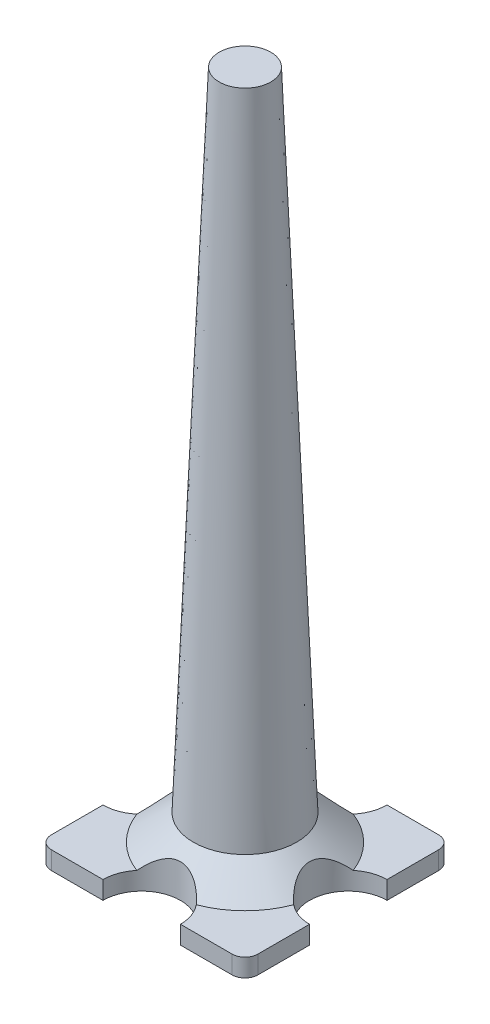
ISO-10303-21;
HEADER;
FILE_DESCRIPTION(('STEP AP214'),'2;1');
FILE_NAME('part.step','',(''),(''),'','','');
FILE_SCHEMA(('AUTOMOTIVE_DESIGN { 1 0 10303 214 1 1 1 1 }'));
ENDSEC;
DATA;
#1=APPLICATION_CONTEXT('core data for automotive mechanical design processes');
#2=APPLICATION_PROTOCOL_DEFINITION('international standard','automotive_design',2000,#1);
#3=PRODUCT_CONTEXT('',#1,'mechanical');
#4=PRODUCT('Part','Part','',(#3));
#5=PRODUCT_RELATED_PRODUCT_CATEGORY('part','',(#4));
#6=PRODUCT_DEFINITION_FORMATION('','',#4);
#7=PRODUCT_DEFINITION_CONTEXT('part definition',#1,'design');
#8=PRODUCT_DEFINITION('design','',#6,#7);
#9=PRODUCT_DEFINITION_SHAPE('','',#8);
#10=(LENGTH_UNIT() NAMED_UNIT(*) SI_UNIT(.MILLI.,.METRE.));
#11=(NAMED_UNIT(*) PLANE_ANGLE_UNIT() SI_UNIT($,.RADIAN.));
#12=(NAMED_UNIT(*) SI_UNIT($,.STERADIAN.) SOLID_ANGLE_UNIT());
#13=UNCERTAINTY_MEASURE_WITH_UNIT(LENGTH_MEASURE(1.E-05),#10,'distance_accuracy_value','');
#14=(GEOMETRIC_REPRESENTATION_CONTEXT(3) GLOBAL_UNCERTAINTY_ASSIGNED_CONTEXT((#13)) GLOBAL_UNIT_ASSIGNED_CONTEXT((#10,
#11,#12)) REPRESENTATION_CONTEXT('',''));
#15=CARTESIAN_POINT('',(0.,0.,0.));
#16=DIRECTION('',(0.,0.,1.));
#17=DIRECTION('',(1.,0.,0.));
#18=AXIS2_PLACEMENT_3D('',#15,#16,#17);
#19=CARTESIAN_POINT('',(44.45,8.89,-44.45));
#20=DIRECTION('',(0.,1.,0.));
#21=DIRECTION('',(0.,0.,1.));
#22=AXIS2_PLACEMENT_3D('',#19,#20,#21);
#23=PLANE('',#22);
#24=CARTESIAN_POINT('',(-50.8,8.89,0.));
#25=DIRECTION('',(0.,1.,0.));
#26=DIRECTION('',(0.,0.,1.));
#27=AXIS2_PLACEMENT_3D('',#24,#25,#26);
#28=CIRCLE('',#27,19.05);
#29=CARTESIAN_POINT('',(-50.8,8.89,19.05));
#30=VERTEX_POINT('',#29);
#31=CARTESIAN_POINT('',(-38.59609375,8.89000000000001,14.6276167655983));
#32=VERTEX_POINT('',#31);
#33=EDGE_CURVE('E56',#30,#32,#28,.T.);
#34=ORIENTED_EDGE('',*,*,#33,.F.);
#35=DIRECTION('',(0.,0.,1.));
#36=VECTOR('',#35,1.);
#37=CARTESIAN_POINT('',(-50.8,8.89,44.45));
#38=LINE('',#37,#36);
#39=CARTESIAN_POINT('',(-50.8,8.89,44.45));
#40=VERTEX_POINT('',#39);
#41=EDGE_CURVE('E194',#30,#40,#38,.T.);
#42=ORIENTED_EDGE('',*,*,#41,.T.);
#43=CARTESIAN_POINT('',(-44.45,8.89,44.45));
#44=DIRECTION('',(0.,1.,0.));
#45=DIRECTION('',(0.,0.,-1.));
#46=AXIS2_PLACEMENT_3D('',#43,#44,#45);
#47=CIRCLE('',#46,6.35);
#48=CARTESIAN_POINT('',(-44.45,8.89,50.8));
#49=VERTEX_POINT('',#48);
#50=EDGE_CURVE('E315',#40,#49,#47,.T.);
#51=ORIENTED_EDGE('',*,*,#50,.T.);
#52=DIRECTION('',(1.,0.,0.));
#53=VECTOR('',#52,1.);
#54=CARTESIAN_POINT('',(44.45,8.89,50.8));
#55=LINE('',#54,#53);
#56=CARTESIAN_POINT('',(-19.05,8.89,50.8));
#57=VERTEX_POINT('',#56);
#58=EDGE_CURVE('E318',#49,#57,#55,.T.);
#59=ORIENTED_EDGE('',*,*,#58,.T.);
#60=CARTESIAN_POINT('',(0.,8.89,50.8));
#61=DIRECTION('',(0.,1.,0.));
#62=DIRECTION('',(0.,0.,1.));
#63=AXIS2_PLACEMENT_3D('',#60,#61,#62);
#64=CIRCLE('',#63,19.05);
#65=CARTESIAN_POINT('',(-14.6276167655983,8.89,38.59609375));
#66=VERTEX_POINT('',#65);
#67=EDGE_CURVE('E372',#66,#57,#64,.T.);
#68=ORIENTED_EDGE('',*,*,#67,.F.);
#69=CARTESIAN_POINT('',(0.,8.89000000000001,0.));
#70=DIRECTION('',(0.,1.,0.));
#71=DIRECTION('',(0.,0.,1.));
#72=AXIS2_PLACEMENT_3D('',#69,#70,#71);
#73=CIRCLE('',#72,41.275);
#74=EDGE_CURVE('E300',#32,#66,#73,.T.);
#75=ORIENTED_EDGE('',*,*,#74,.F.);
#76=EDGE_LOOP('',(#34,#42,#51,#59,#68,#75));
#77=FACE_BOUND('',#76,.T.);
#78=ADVANCED_FACE('F35',(#77),#23,.T.);
#79=CARTESIAN_POINT('',(-50.8,8.89,44.45));
#80=DIRECTION('',(1.,0.,0.));
#81=DIRECTION('',(0.,0.,-1.));
#82=AXIS2_PLACEMENT_3D('',#79,#80,#81);
#83=PLANE('',#82);
#84=DIRECTION('',(0.,0.,1.));
#85=VECTOR('',#84,1.);
#86=CARTESIAN_POINT('',(-50.8,0.,44.45));
#87=LINE('',#86,#85);
#88=CARTESIAN_POINT('',(-50.8,0.,-44.4499999999999));
#89=VERTEX_POINT('',#88);
#90=CARTESIAN_POINT('',(-50.8,0.,-19.05));
#91=VERTEX_POINT('',#90);
#92=EDGE_CURVE('E200',#89,#91,#87,.T.);
#93=ORIENTED_EDGE('',*,*,#92,.T.);
#94=DIRECTION('',(0.,1.,0.));
#95=VECTOR('',#94,1.);
#96=CARTESIAN_POINT('',(-50.8,0.,-19.05));
#97=LINE('',#96,#95);
#98=CARTESIAN_POINT('',(-50.8,8.89,-19.05));
#99=VERTEX_POINT('',#98);
#100=EDGE_CURVE('E180',#91,#99,#97,.T.);
#101=ORIENTED_EDGE('',*,*,#100,.T.);
#102=CARTESIAN_POINT('',(-50.8,8.89,-44.4499999999999));
#103=VERTEX_POINT('',#102);
#104=EDGE_CURVE('E312',#103,#99,#38,.T.);
#105=ORIENTED_EDGE('',*,*,#104,.F.);
#106=DIRECTION('',(0.,-1.,0.));
#107=VECTOR('',#106,1.);
#108=CARTESIAN_POINT('',(-50.8,8.89,-44.4499999999999));
#109=LINE('',#108,#107);
#110=EDGE_CURVE('E234',#103,#89,#109,.T.);
#111=ORIENTED_EDGE('',*,*,#110,.T.);
#112=EDGE_LOOP('',(#93,#101,#105,#111));
#113=FACE_BOUND('',#112,.T.);
#114=ADVANCED_FACE('F345',(#113),#83,.F.);
#115=CARTESIAN_POINT('',(0.,8.89,-50.8));
#116=DIRECTION('',(0.,1.,0.));
#117=DIRECTION('',(0.,0.,1.));
#118=AXIS2_PLACEMENT_3D('',#115,#116,#117);
#119=CIRCLE('',#118,19.05);
#120=CARTESIAN_POINT('',(14.6276167655983,8.89,-38.59609375));
#121=VERTEX_POINT('',#120);
#122=CARTESIAN_POINT('',(19.05,8.89,-50.8));
#123=VERTEX_POINT('',#122);
#124=EDGE_CURVE('E296',#121,#123,#119,.T.);
#125=ORIENTED_EDGE('',*,*,#124,.F.);
#126=CARTESIAN_POINT('',(38.59609375,8.89000000000001,-14.6276167655983));
#127=VERTEX_POINT('',#126);
#128=EDGE_CURVE('E285',#127,#121,#73,.T.);
#129=ORIENTED_EDGE('',*,*,#128,.F.);
#130=CARTESIAN_POINT('',(50.8,8.89,0.));
#131=DIRECTION('',(0.,1.,0.));
#132=DIRECTION('',(0.,0.,1.));
#133=AXIS2_PLACEMENT_3D('',#130,#131,#132);
#134=CIRCLE('',#133,19.05);
#135=CARTESIAN_POINT('',(50.8,8.89,-19.05));
#136=VERTEX_POINT('',#135);
#137=EDGE_CURVE('E293',#136,#127,#134,.T.);
#138=ORIENTED_EDGE('',*,*,#137,.F.);
#139=DIRECTION('',(0.,0.,-1.));
#140=VECTOR('',#139,1.);
#141=CARTESIAN_POINT('',(50.8,8.89,44.45));
#142=LINE('',#141,#140);
#143=CARTESIAN_POINT('',(50.8,8.89,-44.45));
#144=VERTEX_POINT('',#143);
#145=EDGE_CURVE('E323',#136,#144,#142,.T.);
#146=ORIENTED_EDGE('',*,*,#145,.T.);
#147=CARTESIAN_POINT('',(44.45,8.89,-44.45));
#148=DIRECTION('',(0.,1.,0.));
#149=DIRECTION('',(0.,0.,1.));
#150=AXIS2_PLACEMENT_3D('',#147,#148,#149);
#151=CIRCLE('',#150,6.35);
#152=CARTESIAN_POINT('',(44.45,8.89,-50.8));
#153=VERTEX_POINT('',#152);
#154=EDGE_CURVE('E218',#144,#153,#151,.T.);
#155=ORIENTED_EDGE('',*,*,#154,.T.);
#156=DIRECTION('',(-1.,0.,0.));
#157=VECTOR('',#156,1.);
#158=CARTESIAN_POINT('',(44.45,8.89,-50.8));
#159=LINE('',#158,#157);
#160=EDGE_CURVE('E308',#153,#123,#159,.T.);
#161=ORIENTED_EDGE('',*,*,#160,.T.);
#162=EDGE_LOOP('',(#125,#129,#138,#146,#155,#161));
#163=FACE_BOUND('',#162,.T.);
#164=ADVANCED_FACE('F292',(#163),#23,.T.);
#165=CARTESIAN_POINT('',(44.45,8.89,-50.8));
#166=DIRECTION('',(0.,0.,1.));
#167=DIRECTION('',(1.,0.,0.));
#168=AXIS2_PLACEMENT_3D('',#165,#166,#167);
#169=PLANE('',#168);
#170=DIRECTION('',(-1.,0.,0.));
#171=VECTOR('',#170,1.);
#172=CARTESIAN_POINT('',(44.45,0.,-50.8));
#173=LINE('',#172,#171);
#174=CARTESIAN_POINT('',(44.45,0.,-50.8));
#175=VERTEX_POINT('',#174);
#176=CARTESIAN_POINT('',(19.05,0.,-50.8));
#177=VERTEX_POINT('',#176);
#178=EDGE_CURVE('E203',#175,#177,#173,.T.);
#179=ORIENTED_EDGE('',*,*,#178,.T.);
#180=DIRECTION('',(0.,1.,0.));
#181=VECTOR('',#180,1.);
#182=CARTESIAN_POINT('',(19.05,0.,-50.8));
#183=LINE('',#182,#181);
#184=EDGE_CURVE('E356',#177,#123,#183,.T.);
#185=ORIENTED_EDGE('',*,*,#184,.T.);
#186=ORIENTED_EDGE('',*,*,#160,.F.);
#187=DIRECTION('',(0.,-1.,0.));
#188=VECTOR('',#187,1.);
#189=CARTESIAN_POINT('',(44.45,8.89,-50.8));
#190=LINE('',#189,#188);
#191=EDGE_CURVE('E240',#153,#175,#190,.T.);
#192=ORIENTED_EDGE('',*,*,#191,.T.);
#193=EDGE_LOOP('',(#179,#185,#186,#192));
#194=FACE_BOUND('',#193,.T.);
#195=ADVANCED_FACE('F415',(#194),#169,.F.);
#196=CARTESIAN_POINT('',(-38.59609375,8.89000000000001,-14.6276167655982));
#197=VERTEX_POINT('',#196);
#198=EDGE_CURVE('E185',#197,#99,#28,.T.);
#199=ORIENTED_EDGE('',*,*,#198,.F.);
#200=CARTESIAN_POINT('',(-14.6276167655983,8.89000000000001,-38.59609375));
#201=VERTEX_POINT('',#200);
#202=EDGE_CURVE('E297',#201,#197,#73,.T.);
#203=ORIENTED_EDGE('',*,*,#202,.F.);
#204=CARTESIAN_POINT('',(-19.05,8.89,-50.8));
#205=VERTEX_POINT('',#204);
#206=EDGE_CURVE('E63',#205,#201,#119,.T.);
#207=ORIENTED_EDGE('',*,*,#206,.F.);
#208=CARTESIAN_POINT('',(-44.45,8.89,-50.8));
#209=VERTEX_POINT('',#208);
#210=EDGE_CURVE('E307',#205,#209,#159,.T.);
#211=ORIENTED_EDGE('',*,*,#210,.T.);
#212=CARTESIAN_POINT('',(-44.45,8.89,-44.45));
#213=DIRECTION('',(0.,1.,0.));
#214=DIRECTION('',(0.,0.,1.));
#215=AXIS2_PLACEMENT_3D('',#212,#213,#214);
#216=CIRCLE('',#215,6.35);
#217=EDGE_CURVE('E310',#209,#103,#216,.T.);
#218=ORIENTED_EDGE('',*,*,#217,.T.);
#219=ORIENTED_EDGE('',*,*,#104,.T.);
#220=EDGE_LOOP('',(#199,#203,#207,#211,#218,#219));
#221=FACE_BOUND('',#220,.T.);
#222=ADVANCED_FACE('F349',(#221),#23,.T.);
#223=CARTESIAN_POINT('',(50.8,8.89,44.45));
#224=DIRECTION('',(-1.,0.,0.));
#225=DIRECTION('',(0.,0.,1.));
#226=AXIS2_PLACEMENT_3D('',#223,#224,#225);
#227=PLANE('',#226);
#228=DIRECTION('',(0.,0.,-1.));
#229=VECTOR('',#228,1.);
#230=CARTESIAN_POINT('',(50.8,0.,44.45));
#231=LINE('',#230,#229);
#232=CARTESIAN_POINT('',(50.8,0.,44.45));
#233=VERTEX_POINT('',#232);
#234=CARTESIAN_POINT('',(50.8,0.,19.05));
#235=VERTEX_POINT('',#234);
#236=EDGE_CURVE('E215',#233,#235,#231,.T.);
#237=ORIENTED_EDGE('',*,*,#236,.T.);
#238=DIRECTION('',(0.,1.,0.));
#239=VECTOR('',#238,1.);
#240=CARTESIAN_POINT('',(50.8,0.,19.05));
#241=LINE('',#240,#239);
#242=CARTESIAN_POINT('',(50.8,8.89,19.05));
#243=VERTEX_POINT('',#242);
#244=EDGE_CURVE('E366',#235,#243,#241,.T.);
#245=ORIENTED_EDGE('',*,*,#244,.T.);
#246=CARTESIAN_POINT('',(50.8,8.89,44.45));
#247=VERTEX_POINT('',#246);
#248=EDGE_CURVE('E223',#247,#243,#142,.T.);
#249=ORIENTED_EDGE('',*,*,#248,.F.);
#250=DIRECTION('',(0.,-1.,0.));
#251=VECTOR('',#250,1.);
#252=CARTESIAN_POINT('',(50.8,8.89,44.45));
#253=LINE('',#252,#251);
#254=EDGE_CURVE('E222',#247,#233,#253,.T.);
#255=ORIENTED_EDGE('',*,*,#254,.T.);
#256=EDGE_LOOP('',(#237,#245,#249,#255));
#257=FACE_BOUND('',#256,.T.);
#258=ADVANCED_FACE('F405',(#257),#227,.F.);
#259=CARTESIAN_POINT('',(44.45,8.89,50.8));
#260=DIRECTION('',(0.,0.,-1.));
#261=DIRECTION('',(-1.,0.,0.));
#262=AXIS2_PLACEMENT_3D('',#259,#260,#261);
#263=PLANE('',#262);
#264=DIRECTION('',(1.,0.,0.));
#265=VECTOR('',#264,1.);
#266=CARTESIAN_POINT('',(44.45,0.,50.8));
#267=LINE('',#266,#265);
#268=CARTESIAN_POINT('',(-44.45,0.,50.8));
#269=VERTEX_POINT('',#268);
#270=CARTESIAN_POINT('',(-19.05,0.,50.8));
#271=VERTEX_POINT('',#270);
#272=EDGE_CURVE('E209',#269,#271,#267,.T.);
#273=ORIENTED_EDGE('',*,*,#272,.T.);
#274=DIRECTION('',(0.,1.,0.));
#275=VECTOR('',#274,1.);
#276=CARTESIAN_POINT('',(-19.05,0.,50.8));
#277=LINE('',#276,#275);
#278=EDGE_CURVE('E377',#271,#57,#277,.T.);
#279=ORIENTED_EDGE('',*,*,#278,.T.);
#280=ORIENTED_EDGE('',*,*,#58,.F.);
#281=DIRECTION('',(0.,-1.,0.));
#282=VECTOR('',#281,1.);
#283=CARTESIAN_POINT('',(-44.45,8.89,50.8));
#284=LINE('',#283,#282);
#285=EDGE_CURVE('E229',#49,#269,#284,.T.);
#286=ORIENTED_EDGE('',*,*,#285,.T.);
#287=EDGE_LOOP('',(#273,#279,#280,#286));
#288=FACE_BOUND('',#287,.T.);
#289=ADVANCED_FACE('F391',(#288),#263,.F.);
#290=CARTESIAN_POINT('',(38.59609375,8.89,14.6276167655983));
#291=VERTEX_POINT('',#290);
#292=EDGE_CURVE('E361',#291,#243,#134,.T.);
#293=ORIENTED_EDGE('',*,*,#292,.F.);
#294=CARTESIAN_POINT('',(14.6276167655983,8.89000000000001,38.59609375));
#295=VERTEX_POINT('',#294);
#296=EDGE_CURVE('E287',#295,#291,#73,.T.);
#297=ORIENTED_EDGE('',*,*,#296,.F.);
#298=CARTESIAN_POINT('',(19.05,8.89,50.8));
#299=VERTEX_POINT('',#298);
#300=EDGE_CURVE('E374',#299,#295,#64,.T.);
#301=ORIENTED_EDGE('',*,*,#300,.F.);
#302=CARTESIAN_POINT('',(44.45,8.89,50.8));
#303=VERTEX_POINT('',#302);
#304=EDGE_CURVE('E317',#299,#303,#55,.T.);
#305=ORIENTED_EDGE('',*,*,#304,.T.);
#306=CARTESIAN_POINT('',(44.45,8.89,44.45));
#307=DIRECTION('',(0.,1.,0.));
#308=DIRECTION('',(0.,0.,1.));
#309=AXIS2_PLACEMENT_3D('',#306,#307,#308);
#310=CIRCLE('',#309,6.35);
#311=EDGE_CURVE('E321',#303,#247,#310,.T.);
#312=ORIENTED_EDGE('',*,*,#311,.T.);
#313=ORIENTED_EDGE('',*,*,#248,.T.);
#314=EDGE_LOOP('',(#293,#297,#301,#305,#312,#313));
#315=FACE_BOUND('',#314,.T.);
#316=ADVANCED_FACE('F401',(#315),#23,.T.);
#317=CARTESIAN_POINT('',(44.45,8.89,-44.45));
#318=DIRECTION('',(0.,-1.,0.));
#319=DIRECTION('',(0.,0.,-1.));
#320=AXIS2_PLACEMENT_3D('',#317,#318,#319);
#321=CYLINDRICAL_SURFACE('',#320,6.35);
#322=CARTESIAN_POINT('',(44.45,0.,-44.45));
#323=DIRECTION('',(0.,1.,0.));
#324=DIRECTION('',(0.,0.,1.));
#325=AXIS2_PLACEMENT_3D('',#322,#323,#324);
#326=CIRCLE('',#325,6.35);
#327=CARTESIAN_POINT('',(50.8,0.,-44.45));
#328=VERTEX_POINT('',#327);
#329=EDGE_CURVE('E299',#328,#175,#326,.T.);
#330=ORIENTED_EDGE('',*,*,#329,.T.);
#331=ORIENTED_EDGE('',*,*,#191,.F.);
#332=ORIENTED_EDGE('',*,*,#154,.F.);
#333=DIRECTION('',(0.,-1.,0.));
#334=VECTOR('',#333,1.);
#335=CARTESIAN_POINT('',(50.8,8.89,-44.45));
#336=LINE('',#335,#334);
#337=EDGE_CURVE('E219',#144,#328,#336,.T.);
#338=ORIENTED_EDGE('',*,*,#337,.T.);
#339=EDGE_LOOP('',(#330,#331,#332,#338));
#340=FACE_BOUND('',#339,.T.);
#341=ADVANCED_FACE('F37',(#340),#321,.T.);
#342=ORIENTED_EDGE('',*,*,#210,.F.);
#343=DIRECTION('',(0.,1.,0.));
#344=VECTOR('',#343,1.);
#345=CARTESIAN_POINT('',(-19.05,0.,-50.8));
#346=LINE('',#345,#344);
#347=CARTESIAN_POINT('',(-19.05,0.,-50.8));
#348=VERTEX_POINT('',#347);
#349=EDGE_CURVE('E338',#205,#348,#346,.F.);
#350=ORIENTED_EDGE('',*,*,#349,.T.);
#351=CARTESIAN_POINT('',(-44.45,0.,-50.8));
#352=VERTEX_POINT('',#351);
#353=EDGE_CURVE('E327',#348,#352,#173,.T.);
#354=ORIENTED_EDGE('',*,*,#353,.T.);
#355=DIRECTION('',(0.,-1.,0.));
#356=VECTOR('',#355,1.);
#357=CARTESIAN_POINT('',(-44.45,8.89,-50.8));
#358=LINE('',#357,#356);
#359=EDGE_CURVE('E237',#209,#352,#358,.T.);
#360=ORIENTED_EDGE('',*,*,#359,.F.);
#361=EDGE_LOOP('',(#342,#350,#354,#360));
#362=FACE_BOUND('',#361,.T.);
#363=ADVANCED_FACE('F336',(#362),#169,.F.);
#364=CARTESIAN_POINT('',(-44.45,8.89,-44.45));
#365=DIRECTION('',(0.,-1.,0.));
#366=DIRECTION('',(0.,0.,-1.));
#367=AXIS2_PLACEMENT_3D('',#364,#365,#366);
#368=CYLINDRICAL_SURFACE('',#367,6.35);
#369=CARTESIAN_POINT('',(-44.45,0.,-44.45));
#370=DIRECTION('',(0.,1.,0.));
#371=DIRECTION('',(0.,0.,1.));
#372=AXIS2_PLACEMENT_3D('',#369,#370,#371);
#373=CIRCLE('',#372,6.35);
#374=EDGE_CURVE('E201',#352,#89,#373,.T.);
#375=ORIENTED_EDGE('',*,*,#374,.T.);
#376=ORIENTED_EDGE('',*,*,#110,.F.);
#377=ORIENTED_EDGE('',*,*,#217,.F.);
#378=ORIENTED_EDGE('',*,*,#359,.T.);
#379=EDGE_LOOP('',(#375,#376,#377,#378));
#380=FACE_BOUND('',#379,.T.);
#381=ADVANCED_FACE('F342',(#380),#368,.T.);
#382=ORIENTED_EDGE('',*,*,#41,.F.);
#383=DIRECTION('',(0.,1.,0.));
#384=VECTOR('',#383,1.);
#385=CARTESIAN_POINT('',(-50.8,0.,19.05));
#386=LINE('',#385,#384);
#387=CARTESIAN_POINT('',(-50.8,0.,19.05));
#388=VERTEX_POINT('',#387);
#389=EDGE_CURVE('E178',#30,#388,#386,.F.);
#390=ORIENTED_EDGE('',*,*,#389,.T.);
#391=CARTESIAN_POINT('',(-50.8,0.,44.45));
#392=VERTEX_POINT('',#391);
#393=EDGE_CURVE('E192',#388,#392,#87,.T.);
#394=ORIENTED_EDGE('',*,*,#393,.T.);
#395=DIRECTION('',(0.,-1.,0.));
#396=VECTOR('',#395,1.);
#397=CARTESIAN_POINT('',(-50.8,8.89,44.45));
#398=LINE('',#397,#396);
#399=EDGE_CURVE('E232',#40,#392,#398,.T.);
#400=ORIENTED_EDGE('',*,*,#399,.F.);
#401=EDGE_LOOP('',(#382,#390,#394,#400));
#402=FACE_BOUND('',#401,.T.);
#403=ADVANCED_FACE('F190',(#402),#83,.F.);
#404=CARTESIAN_POINT('',(-44.45,8.89,44.45));
#405=DIRECTION('',(0.,-1.,0.));
#406=DIRECTION('',(0.,0.,-1.));
#407=AXIS2_PLACEMENT_3D('',#404,#405,#406);
#408=CYLINDRICAL_SURFACE('',#407,6.35);
#409=CARTESIAN_POINT('',(-44.45,0.,44.45));
#410=DIRECTION('',(0.,1.,0.));
#411=DIRECTION('',(0.,0.,-1.));
#412=AXIS2_PLACEMENT_3D('',#409,#410,#411);
#413=CIRCLE('',#412,6.35);
#414=EDGE_CURVE('E199',#392,#269,#413,.T.);
#415=ORIENTED_EDGE('',*,*,#414,.T.);
#416=ORIENTED_EDGE('',*,*,#285,.F.);
#417=ORIENTED_EDGE('',*,*,#50,.F.);
#418=ORIENTED_EDGE('',*,*,#399,.T.);
#419=EDGE_LOOP('',(#415,#416,#417,#418));
#420=FACE_BOUND('',#419,.T.);
#421=ADVANCED_FACE('F443',(#420),#408,.T.);
#422=ORIENTED_EDGE('',*,*,#304,.F.);
#423=DIRECTION('',(0.,1.,0.));
#424=VECTOR('',#423,1.);
#425=CARTESIAN_POINT('',(19.05,0.,50.8));
#426=LINE('',#425,#424);
#427=CARTESIAN_POINT('',(19.05,0.,50.8));
#428=VERTEX_POINT('',#427);
#429=EDGE_CURVE('E375',#299,#428,#426,.F.);
#430=ORIENTED_EDGE('',*,*,#429,.T.);
#431=CARTESIAN_POINT('',(44.45,0.,50.8));
#432=VERTEX_POINT('',#431);
#433=EDGE_CURVE('E208',#428,#432,#267,.T.);
#434=ORIENTED_EDGE('',*,*,#433,.T.);
#435=DIRECTION('',(0.,-1.,0.));
#436=VECTOR('',#435,1.);
#437=CARTESIAN_POINT('',(44.45,8.89,50.8));
#438=LINE('',#437,#436);
#439=EDGE_CURVE('E226',#303,#432,#438,.T.);
#440=ORIENTED_EDGE('',*,*,#439,.F.);
#441=EDGE_LOOP('',(#422,#430,#434,#440));
#442=FACE_BOUND('',#441,.T.);
#443=ADVANCED_FACE('F397',(#442),#263,.F.);
#444=CARTESIAN_POINT('',(44.45,8.89,44.45));
#445=DIRECTION('',(0.,-1.,0.));
#446=DIRECTION('',(0.,0.,-1.));
#447=AXIS2_PLACEMENT_3D('',#444,#445,#446);
#448=CYLINDRICAL_SURFACE('',#447,6.35);
#449=CARTESIAN_POINT('',(44.45,0.,44.45));
#450=DIRECTION('',(0.,1.,0.));
#451=DIRECTION('',(0.,0.,1.));
#452=AXIS2_PLACEMENT_3D('',#449,#450,#451);
#453=CIRCLE('',#452,6.35);
#454=EDGE_CURVE('E212',#432,#233,#453,.T.);
#455=ORIENTED_EDGE('',*,*,#454,.T.);
#456=ORIENTED_EDGE('',*,*,#254,.F.);
#457=ORIENTED_EDGE('',*,*,#311,.F.);
#458=ORIENTED_EDGE('',*,*,#439,.T.);
#459=EDGE_LOOP('',(#455,#456,#457,#458));
#460=FACE_BOUND('',#459,.T.);
#461=ADVANCED_FACE('F442',(#460),#448,.T.);
#462=ORIENTED_EDGE('',*,*,#145,.F.);
#463=DIRECTION('',(0.,1.,0.));
#464=VECTOR('',#463,1.);
#465=CARTESIAN_POINT('',(50.8,0.,-19.05));
#466=LINE('',#465,#464);
#467=CARTESIAN_POINT('',(50.8,0.,-19.05));
#468=VERTEX_POINT('',#467);
#469=EDGE_CURVE('E363',#136,#468,#466,.F.);
#470=ORIENTED_EDGE('',*,*,#469,.T.);
#471=EDGE_CURVE('E214',#468,#328,#231,.T.);
#472=ORIENTED_EDGE('',*,*,#471,.T.);
#473=ORIENTED_EDGE('',*,*,#337,.F.);
#474=EDGE_LOOP('',(#462,#470,#472,#473));
#475=FACE_BOUND('',#474,.T.);
#476=ADVANCED_FACE('F410',(#475),#227,.F.);
#477=CARTESIAN_POINT('',(44.45,0.,-44.45));
#478=DIRECTION('',(0.,1.,0.));
#479=DIRECTION('',(0.,0.,1.));
#480=AXIS2_PLACEMENT_3D('',#477,#478,#479);
#481=PLANE('',#480);
#482=ORIENTED_EDGE('',*,*,#393,.F.);
#483=CARTESIAN_POINT('',(-50.8,0.,0.));
#484=DIRECTION('',(0.,1.,0.));
#485=DIRECTION('',(0.,0.,1.));
#486=AXIS2_PLACEMENT_3D('',#483,#484,#485);
#487=CIRCLE('',#486,19.05);
#488=EDGE_CURVE('E175',#388,#91,#487,.T.);
#489=ORIENTED_EDGE('',*,*,#488,.T.);
#490=ORIENTED_EDGE('',*,*,#92,.F.);
#491=ORIENTED_EDGE('',*,*,#374,.F.);
#492=ORIENTED_EDGE('',*,*,#353,.F.);
#493=CARTESIAN_POINT('',(0.,0.,-50.8));
#494=DIRECTION('',(0.,1.,0.));
#495=DIRECTION('',(0.,0.,1.));
#496=AXIS2_PLACEMENT_3D('',#493,#494,#495);
#497=CIRCLE('',#496,19.05);
#498=EDGE_CURVE('E350',#348,#177,#497,.T.);
#499=ORIENTED_EDGE('',*,*,#498,.T.);
#500=ORIENTED_EDGE('',*,*,#178,.F.);
#501=ORIENTED_EDGE('',*,*,#329,.F.);
#502=ORIENTED_EDGE('',*,*,#471,.F.);
#503=CARTESIAN_POINT('',(50.8,0.,0.));
#504=DIRECTION('',(0.,1.,0.));
#505=DIRECTION('',(0.,0.,1.));
#506=AXIS2_PLACEMENT_3D('',#503,#504,#505);
#507=CIRCLE('',#506,19.05);
#508=EDGE_CURVE('E358',#468,#235,#507,.T.);
#509=ORIENTED_EDGE('',*,*,#508,.T.);
#510=ORIENTED_EDGE('',*,*,#236,.F.);
#511=ORIENTED_EDGE('',*,*,#454,.F.);
#512=ORIENTED_EDGE('',*,*,#433,.F.);
#513=CARTESIAN_POINT('',(0.,0.,50.8));
#514=DIRECTION('',(0.,1.,0.));
#515=DIRECTION('',(0.,0.,1.));
#516=AXIS2_PLACEMENT_3D('',#513,#514,#515);
#517=CIRCLE('',#516,19.05);
#518=EDGE_CURVE('E369',#428,#271,#517,.T.);
#519=ORIENTED_EDGE('',*,*,#518,.T.);
#520=ORIENTED_EDGE('',*,*,#272,.F.);
#521=ORIENTED_EDGE('',*,*,#414,.F.);
#522=EDGE_LOOP('',(#482,#489,#490,#491,#492,#499,#500,#501,#502,#509,#510,#511,#512,#519,#520,#521));
#523=FACE_BOUND('',#522,.T.);
#524=ADVANCED_FACE('F197',(#523),#481,.F.);
#525=CARTESIAN_POINT('',(0.,8.89000000000001,0.));
#526=DIRECTION('',(0.,-1.,0.));
#527=DIRECTION('',(0.,0.,-1.));
#528=AXIS2_PLACEMENT_3D('',#525,#526,#527);
#529=CONICAL_SURFACE('',#528,41.275,0.896055384571344);
#530=CARTESIAN_POINT('',(0.,21.59,0.));
#531=DIRECTION('',(0.,1.,0.));
#532=DIRECTION('',(0.,0.,1.));
#533=AXIS2_PLACEMENT_3D('',#530,#531,#532);
#534=CIRCLE('',#533,25.4);
#535=CARTESIAN_POINT('',(0.,21.59,25.4));
#536=VERTEX_POINT('',#535);
#537=EDGE_CURVE('E303',#536,#536,#534,.T.);
#538=ORIENTED_EDGE('',*,*,#537,.F.);
#539=EDGE_LOOP('',(#538));
#540=FACE_BOUND('',#539,.T.);
#541=ORIENTED_EDGE('',*,*,#202,.T.);
#542=CARTESIAN_POINT('',(-38.5962968756152,8.8898,-14.6277862320954));
#543=CARTESIAN_POINT('',(-38.3895712066562,9.09334093258543,-14.4553103378079));
#544=CARTESIAN_POINT('',(-38.185879481952,9.29578372526318,-14.2779496232321));
#545=CARTESIAN_POINT('',(-37.7848155019923,9.69807231056853,-13.9133384710445));
#546=CARTESIAN_POINT('',(-37.5874440244564,9.89791778180636,-13.726086823787));
#547=CARTESIAN_POINT('',(-37.0045003504226,10.4936612258947,-13.1486256529755));
#548=CARTESIAN_POINT('',(-36.6289130128614,10.884963493328,-12.7433864180333));
#549=CARTESIAN_POINT('',(-35.9024158774759,11.655788068097,-11.8863197131806));
#550=CARTESIAN_POINT('',(-35.551924250546,12.0350693613105,-11.4339203664525));
#551=CARTESIAN_POINT('',(-34.8855084245347,12.7693458740593,-10.4864901727826));
#552=CARTESIAN_POINT('',(-34.569551316532,13.1243640914878,-9.99150072959529));
#553=CARTESIAN_POINT('',(-34.0836232321281,13.6797200681411,-9.14387974879918));
#554=CARTESIAN_POINT('',(-33.9020537398285,13.8897219669684,-8.80417218465487));
#555=CARTESIAN_POINT('',(-33.5565177485086,14.2935607959959,-8.10655988655948));
#556=CARTESIAN_POINT('',(-33.3925513912795,14.4873975959853,-7.74865500606516));
#557=CARTESIAN_POINT('',(-33.0847145466771,14.854831882197,-7.01628842765122));
#558=CARTESIAN_POINT('',(-32.9407655814761,15.0285079384004,-6.64189942636075));
#559=CARTESIAN_POINT('',(-32.6742937262959,15.3527492540423,-5.87584970924707));
#560=CARTESIAN_POINT('',(-32.5517662330081,15.503319477893,-5.48419272688742));
#561=CARTESIAN_POINT('',(-32.3511895496758,15.7515567021698,-4.75997589966932));
#562=CARTESIAN_POINT('',(-32.2691084943697,15.853849068057,-4.43011690308063));
#563=CARTESIAN_POINT('',(-32.1218428896968,16.038254329191,-3.7611407003961));
#564=CARTESIAN_POINT('',(-32.0566543322811,16.1203720110042,-3.42202571159642));
#565=CARTESIAN_POINT('',(-31.9443470350621,16.2623435952303,-2.73632649137669));
#566=CARTESIAN_POINT('',(-31.8972212804231,16.3222061403339,-2.38974521489371));
#567=CARTESIAN_POINT('',(-31.8219692842788,16.4180004521219,-1.69121993167089));
#568=CARTESIAN_POINT('',(-31.7938429491817,16.4539323366898,-1.33927595135669));
#569=CARTESIAN_POINT('',(-31.7571457817113,16.5008439581354,-0.631191903907878));
#570=CARTESIAN_POINT('',(-31.7486584095847,16.5117172018285,-0.275040370070849));
#571=CARTESIAN_POINT('',(-31.7516859898874,16.50784196876,0.437037657637589));
#572=CARTESIAN_POINT('',(-31.7632010194391,16.4930933932095,0.792964150636027));
#573=CARTESIAN_POINT('',(-31.8059689723253,16.4384460378205,1.50180575402912));
#574=CARTESIAN_POINT('',(-31.8372296383497,16.3985373921877,1.85471962806701));
#575=CARTESIAN_POINT('',(-31.9187937680413,16.2948029090494,2.55475149483904));
#576=CARTESIAN_POINT('',(-31.9690974541607,16.2309767921506,2.901869419818));
#577=CARTESIAN_POINT('',(-32.0843573539001,16.085472721074,3.56862774739105));
#578=CARTESIAN_POINT('',(-32.1483192018679,16.0050144358508,3.88870909883004));
#579=CARTESIAN_POINT('',(-32.2912720249076,15.8262179323484,4.52045375411812));
#580=CARTESIAN_POINT('',(-32.3702684101403,15.7278732782473,4.83211398139017));
#581=CARTESIAN_POINT('',(-32.6282272186782,15.4088520376549,5.75282652820665));
#582=CARTESIAN_POINT('',(-32.8282082017923,15.1641254998118,6.34788551065139));
#583=CARTESIAN_POINT('',(-33.2366343668702,14.6725917517083,7.39525313085371));
#584=CARTESIAN_POINT('',(-33.4375187063837,14.4335933076176,7.85435667858227));
#585=CARTESIAN_POINT('',(-33.8680156239613,13.9288361672021,8.74382467634853));
#586=CARTESIAN_POINT('',(-34.097644950071,13.6630618879083,9.1741721458275));
#587=CARTESIAN_POINT('',(-34.5830585410071,13.1097635224484,10.007327284111));
#588=CARTESIAN_POINT('',(-34.8389233932695,12.8221731732923,10.4100433470783));
#589=CARTESIAN_POINT('',(-35.3735327172093,12.2306464259561,11.1869955387313));
#590=CARTESIAN_POINT('',(-35.6522708641666,11.9267145543494,11.5612394854844));
#591=CARTESIAN_POINT('',(-36.1446474753079,11.3982770019186,12.1749177010246));
#592=CARTESIAN_POINT('',(-36.3530416623198,11.1769828858617,12.4213860130506));
#593=CARTESIAN_POINT('',(-36.7794724345684,10.7291318114562,12.900783055968));
#594=CARTESIAN_POINT('',(-36.9975081672571,10.5025753192678,13.1337129797847));
#595=CARTESIAN_POINT('',(-37.4408502469439,10.0469604888984,13.5843564222283));
#596=CARTESIAN_POINT('',(-37.6660829706643,9.81793752357738,13.8021783617043));
#597=CARTESIAN_POINT('',(-38.1249829254417,9.35634693685264,14.2247536938674));
#598=CARTESIAN_POINT('',(-38.3586496415529,9.12377953235741,14.4295078823128));
#599=CARTESIAN_POINT('',(-38.5962968756152,8.88980000000001,14.6277862320954));
#600=B_SPLINE_CURVE_WITH_KNOTS('',3,(#542,#543,#544,#545,#546,#547,#548,#549,#550,#551,#552,
#553,#554,#555,#556,#557,#558,#559,#560,#561,#562,#563,#564,#565,#566,#567,#568,#569,#570,#571,
#572,#573,#574,#575,#576,#577,#578,#579,#580,#581,#582,#583,#584,#585,#586,#587,#588,#589,#590,
#591,#592,#593,#594,#595,#596,#597,#598,#599),.UNSPECIFIED.,.F.,.F.,(4,2,2,2,2,2,2,2,2,2,2,2,2,
2,2,2,2,2,2,2,2,2,2,2,2,2,2,2,4),(0.,1.01242135860384,2.02496682273099,4.05403384803494,
6.11145419121535,8.16689654551862,9.48216662830086,10.7974473046485,12.1074165798777,
13.4171040059078,14.4810405701614,15.5447244647053,16.6079948494241,17.6712599963894,
18.7390354970724,19.806815114737,20.8750136919598,21.9432247477924,22.9507713639221,
23.958681232416,25.9736504905671,27.6371526310038,29.3016285491879,30.9713797644777,
32.6406708208015,33.8143208697777,34.9878673461487,36.1518618573755,37.3157854195988),.UNSPECIFIED.);
#601=EDGE_CURVE('E11',#197,#32,#600,.T.);
#602=ORIENTED_EDGE('',*,*,#601,.T.);
#603=ORIENTED_EDGE('',*,*,#74,.T.);
#604=CARTESIAN_POINT('',(-14.6277862320954,8.8898,38.5962968756152));
#605=CARTESIAN_POINT('',(-14.4553103378079,9.09334093258543,38.3895712066562));
#606=CARTESIAN_POINT('',(-14.2779496232321,9.29578372526318,38.185879481952));
#607=CARTESIAN_POINT('',(-13.9133384710445,9.69807231056853,37.7848155019923));
#608=CARTESIAN_POINT('',(-13.726086823787,9.89791778180636,37.5874440244564));
#609=CARTESIAN_POINT('',(-13.1486256529755,10.4936612258947,37.0045003504226));
#610=CARTESIAN_POINT('',(-12.7433864180333,10.884963493328,36.6289130128614));
#611=CARTESIAN_POINT('',(-11.8863197131806,11.655788068097,35.9024158774759));
#612=CARTESIAN_POINT('',(-11.4339203664525,12.0350693613105,35.551924250546));
#613=CARTESIAN_POINT('',(-10.4864901727826,12.7693458740593,34.8855084245347));
#614=CARTESIAN_POINT('',(-9.99150072959529,13.1243640914878,34.569551316532));
#615=CARTESIAN_POINT('',(-9.14387974879919,13.6797200681411,34.0836232321281));
#616=CARTESIAN_POINT('',(-8.80417218465488,13.8897219669684,33.9020537398285));
#617=CARTESIAN_POINT('',(-8.10655988655948,14.2935607959959,33.5565177485085));
#618=CARTESIAN_POINT('',(-7.74865500606516,14.4873975959854,33.3925513912795));
#619=CARTESIAN_POINT('',(-7.01628842765122,14.854831882197,33.0847145466771));
#620=CARTESIAN_POINT('',(-6.64189942636075,15.0285079384004,32.9407655814761));
#621=CARTESIAN_POINT('',(-5.87584970924707,15.3527492540423,32.6742937262959));
#622=CARTESIAN_POINT('',(-5.48419272688742,15.503319477893,32.5517662330081));
#623=CARTESIAN_POINT('',(-4.75997589966932,15.7515567021698,32.3511895496758));
#624=CARTESIAN_POINT('',(-4.43011690308063,15.853849068057,32.2691084943697));
#625=CARTESIAN_POINT('',(-3.76114070039611,16.038254329191,32.1218428896968));
#626=CARTESIAN_POINT('',(-3.42202571159642,16.1203720110042,32.0566543322811));
#627=CARTESIAN_POINT('',(-2.7363264913767,16.2623435952303,31.9443470350621));
#628=CARTESIAN_POINT('',(-2.38974521489372,16.3222061403339,31.8972212804231));
#629=CARTESIAN_POINT('',(-1.69121993167089,16.4180004521219,31.8219692842788));
#630=CARTESIAN_POINT('',(-1.33927595135669,16.4539323366898,31.7938429491817));
#631=CARTESIAN_POINT('',(-0.631191903907884,16.5008439581354,31.7571457817113));
#632=CARTESIAN_POINT('',(-0.275040370070856,16.5117172018285,31.7486584095847));
#633=CARTESIAN_POINT('',(0.437037657637582,16.50784196876,31.7516859898874));
#634=CARTESIAN_POINT('',(0.79296415063602,16.4930933932095,31.7632010194391));
#635=CARTESIAN_POINT('',(1.50180575402912,16.4384460378205,31.8059689723253));
#636=CARTESIAN_POINT('',(1.85471962806701,16.3985373921877,31.8372296383497));
#637=CARTESIAN_POINT('',(2.55475149483904,16.2948029090494,31.9187937680413));
#638=CARTESIAN_POINT('',(2.90186941981799,16.2309767921506,31.9690974541607));
#639=CARTESIAN_POINT('',(3.56862774739105,16.085472721074,32.0843573539001));
#640=CARTESIAN_POINT('',(3.88870909883003,16.0050144358508,32.1483192018679));
#641=CARTESIAN_POINT('',(4.52045375411812,15.8262179323484,32.2912720249076));
#642=CARTESIAN_POINT('',(4.83211398139016,15.7278732782473,32.3702684101403));
#643=CARTESIAN_POINT('',(5.75282652820664,15.4088520376549,32.6282272186782));
#644=CARTESIAN_POINT('',(6.34788551065139,15.1641254998118,32.8282082017923));
#645=CARTESIAN_POINT('',(7.3952531308537,14.6725917517083,33.2366343668702));
#646=CARTESIAN_POINT('',(7.85435667858226,14.4335933076176,33.4375187063837));
#647=CARTESIAN_POINT('',(8.74382467634851,13.9288361672021,33.8680156239613));
#648=CARTESIAN_POINT('',(9.17417214582749,13.6630618879083,34.097644950071));
#649=CARTESIAN_POINT('',(10.007327284111,13.1097635224485,34.5830585410071));
#650=CARTESIAN_POINT('',(10.4100433470782,12.8221731732923,34.8389233932695));
#651=CARTESIAN_POINT('',(11.1869955387313,12.2306464259561,35.3735327172093));
#652=CARTESIAN_POINT('',(11.5612394854844,11.9267145543494,35.6522708641666));
#653=CARTESIAN_POINT('',(12.1749177010246,11.3982770019186,36.1446474753079));
#654=CARTESIAN_POINT('',(12.4213860130506,11.1769828858617,36.3530416623198));
#655=CARTESIAN_POINT('',(12.900783055968,10.7291318114562,36.7794724345684));
#656=CARTESIAN_POINT('',(13.1337129797847,10.5025753192678,36.9975081672571));
#657=CARTESIAN_POINT('',(13.5843564222283,10.0469604888984,37.4408502469439));
#658=CARTESIAN_POINT('',(13.8021783617043,9.81793752357738,37.6660829706644));
#659=CARTESIAN_POINT('',(14.2247536938674,9.35634693685263,38.1249829254417));
#660=CARTESIAN_POINT('',(14.4295078823128,9.1237795323574,38.3586496415529));
#661=CARTESIAN_POINT('',(14.6277862320954,8.8898,38.5962968756152));
#662=B_SPLINE_CURVE_WITH_KNOTS('',3,(#604,#605,#606,#607,#608,#609,#610,#611,#612,#613,#614,
#615,#616,#617,#618,#619,#620,#621,#622,#623,#624,#625,#626,#627,#628,#629,#630,#631,#632,#633,
#634,#635,#636,#637,#638,#639,#640,#641,#642,#643,#644,#645,#646,#647,#648,#649,#650,#651,#652,
#653,#654,#655,#656,#657,#658,#659,#660,#661),.UNSPECIFIED.,.F.,.F.,(4,2,2,2,2,2,2,2,2,2,2,2,2,
2,2,2,2,2,2,2,2,2,2,2,2,2,2,2,4),(0.,1.01242135860384,2.02496682273099,4.05403384803494,
6.11145419121536,8.16689654551863,9.48216662830086,10.7974473046485,12.1074165798777,
13.4171040059078,14.4810405701614,15.5447244647053,16.6079948494241,17.6712599963894,
18.7390354970724,19.806815114737,20.8750136919598,21.9432247477924,22.9507713639221,
23.958681232416,25.9736504905671,27.6371526310038,29.3016285491879,30.9713797644777,
32.6406708208015,33.8143208697777,34.9878673461487,36.1518618573755,37.3157854195988),.UNSPECIFIED.);
#663=EDGE_CURVE('E243',#66,#295,#662,.T.);
#664=ORIENTED_EDGE('',*,*,#663,.T.);
#665=ORIENTED_EDGE('',*,*,#296,.T.);
#666=CARTESIAN_POINT('',(38.5962968756152,8.8898,14.6277862320954));
#667=CARTESIAN_POINT('',(38.3895712066562,9.09334093258543,14.4553103378079));
#668=CARTESIAN_POINT('',(38.185879481952,9.29578372526318,14.2779496232321));
#669=CARTESIAN_POINT('',(37.7848155019923,9.69807231056853,13.9133384710445));
#670=CARTESIAN_POINT('',(37.5874440244564,9.89791778180636,13.726086823787));
#671=CARTESIAN_POINT('',(37.0045003504226,10.4936612258947,13.1486256529755));
#672=CARTESIAN_POINT('',(36.6289130128614,10.884963493328,12.7433864180333));
#673=CARTESIAN_POINT('',(35.9024158774759,11.655788068097,11.8863197131806));
#674=CARTESIAN_POINT('',(35.551924250546,12.0350693613105,11.4339203664525));
#675=CARTESIAN_POINT('',(34.8855084245347,12.7693458740593,10.4864901727826));
#676=CARTESIAN_POINT('',(34.569551316532,13.1243640914878,9.99150072959529));
#677=CARTESIAN_POINT('',(34.0836232321281,13.6797200681411,9.14387974879919));
#678=CARTESIAN_POINT('',(33.9020537398285,13.8897219669684,8.80417218465488));
#679=CARTESIAN_POINT('',(33.5565177485085,14.2935607959959,8.10655988655948));
#680=CARTESIAN_POINT('',(33.3925513912795,14.4873975959854,7.74865500606516));
#681=CARTESIAN_POINT('',(33.0847145466771,14.854831882197,7.01628842765122));
#682=CARTESIAN_POINT('',(32.9407655814761,15.0285079384004,6.64189942636075));
#683=CARTESIAN_POINT('',(32.6742937262959,15.3527492540423,5.87584970924707));
#684=CARTESIAN_POINT('',(32.5517662330081,15.503319477893,5.48419272688742));
#685=CARTESIAN_POINT('',(32.3511895496758,15.7515567021698,4.75997589966932));
#686=CARTESIAN_POINT('',(32.2691084943697,15.853849068057,4.43011690308063));
#687=CARTESIAN_POINT('',(32.1218428896968,16.038254329191,3.76114070039611));
#688=CARTESIAN_POINT('',(32.0566543322811,16.1203720110042,3.42202571159642));
#689=CARTESIAN_POINT('',(31.9443470350621,16.2623435952303,2.73632649137669));
#690=CARTESIAN_POINT('',(31.8972212804231,16.3222061403339,2.38974521489372));
#691=CARTESIAN_POINT('',(31.8219692842788,16.4180004521219,1.69121993167089));
#692=CARTESIAN_POINT('',(31.7938429491817,16.4539323366898,1.33927595135669));
#693=CARTESIAN_POINT('',(31.7571457817113,16.5008439581354,0.631191903907882));
#694=CARTESIAN_POINT('',(31.7486584095847,16.5117172018285,0.275040370070854));
#695=CARTESIAN_POINT('',(31.7516859898874,16.50784196876,-0.437037657637583));
#696=CARTESIAN_POINT('',(31.7632010194391,16.4930933932095,-0.792964150636021));
#697=CARTESIAN_POINT('',(31.8059689723253,16.4384460378205,-1.50180575402912));
#698=CARTESIAN_POINT('',(31.8372296383497,16.3985373921877,-1.85471962806701));
#699=CARTESIAN_POINT('',(31.9187937680413,16.2948029090494,-2.55475149483904));
#700=CARTESIAN_POINT('',(31.9690974541607,16.2309767921506,-2.90186941981799));
#701=CARTESIAN_POINT('',(32.0843573539001,16.085472721074,-3.56862774739105));
#702=CARTESIAN_POINT('',(32.1483192018679,16.0050144358508,-3.88870909883003));
#703=CARTESIAN_POINT('',(32.2912720249076,15.8262179323484,-4.52045375411812));
#704=CARTESIAN_POINT('',(32.3702684101403,15.7278732782473,-4.83211398139016));
#705=CARTESIAN_POINT('',(32.6282272186782,15.4088520376549,-5.75282652820664));
#706=CARTESIAN_POINT('',(32.8282082017923,15.1641254998118,-6.34788551065139));
#707=CARTESIAN_POINT('',(33.2366343668702,14.6725917517083,-7.3952531308537));
#708=CARTESIAN_POINT('',(33.4375187063837,14.4335933076176,-7.85435667858226));
#709=CARTESIAN_POINT('',(33.8680156239613,13.9288361672021,-8.74382467634852));
#710=CARTESIAN_POINT('',(34.097644950071,13.6630618879083,-9.17417214582749));
#711=CARTESIAN_POINT('',(34.5830585410071,13.1097635224485,-10.007327284111));
#712=CARTESIAN_POINT('',(34.8389233932695,12.8221731732923,-10.4100433470782));
#713=CARTESIAN_POINT('',(35.3735327172093,12.2306464259561,-11.1869955387313));
#714=CARTESIAN_POINT('',(35.6522708641666,11.9267145543494,-11.5612394854844));
#715=CARTESIAN_POINT('',(36.1446474753079,11.3982770019186,-12.1749177010246));
#716=CARTESIAN_POINT('',(36.3530416623198,11.1769828858617,-12.4213860130506));
#717=CARTESIAN_POINT('',(36.7794724345684,10.7291318114562,-12.900783055968));
#718=CARTESIAN_POINT('',(36.9975081672571,10.5025753192678,-13.1337129797847));
#719=CARTESIAN_POINT('',(37.4408502469439,10.0469604888984,-13.5843564222283));
#720=CARTESIAN_POINT('',(37.6660829706644,9.81793752357738,-13.8021783617043));
#721=CARTESIAN_POINT('',(38.1249829254417,9.35634693685264,-14.2247536938674));
#722=CARTESIAN_POINT('',(38.3586496415529,9.1237795323574,-14.4295078823128));
#723=CARTESIAN_POINT('',(38.5962968756152,8.8898,-14.6277862320954));
#724=B_SPLINE_CURVE_WITH_KNOTS('',3,(#666,#667,#668,#669,#670,#671,#672,#673,#674,#675,#676,
#677,#678,#679,#680,#681,#682,#683,#684,#685,#686,#687,#688,#689,#690,#691,#692,#693,#694,#695,
#696,#697,#698,#699,#700,#701,#702,#703,#704,#705,#706,#707,#708,#709,#710,#711,#712,#713,#714,
#715,#716,#717,#718,#719,#720,#721,#722,#723),.UNSPECIFIED.,.F.,.F.,(4,2,2,2,2,2,2,2,2,2,2,2,2,
2,2,2,2,2,2,2,2,2,2,2,2,2,2,2,4),(0.,1.01242135860384,2.02496682273099,4.05403384803494,
6.11145419121536,8.16689654551863,9.48216662830086,10.7974473046485,12.1074165798777,
13.4171040059078,14.4810405701614,15.5447244647053,16.6079948494241,17.6712599963894,
18.7390354970724,19.806815114737,20.8750136919598,21.9432247477924,22.9507713639221,
23.958681232416,25.9736504905671,27.6371526310038,29.3016285491879,30.9713797644777,
32.6406708208015,33.8143208697777,34.9878673461487,36.1518618573755,37.3157854195988),.UNSPECIFIED.);
#725=EDGE_CURVE('E251',#291,#127,#724,.T.);
#726=ORIENTED_EDGE('',*,*,#725,.T.);
#727=ORIENTED_EDGE('',*,*,#128,.T.);
#728=CARTESIAN_POINT('',(14.6277862320954,8.8898,-38.5962968756152));
#729=CARTESIAN_POINT('',(14.4553103378079,9.09334093258543,-38.3895712066562));
#730=CARTESIAN_POINT('',(14.2779496232321,9.29578372526318,-38.185879481952));
#731=CARTESIAN_POINT('',(13.9133384710445,9.69807231056853,-37.7848155019923));
#732=CARTESIAN_POINT('',(13.726086823787,9.89791778180636,-37.5874440244564));
#733=CARTESIAN_POINT('',(13.1486256529755,10.4936612258947,-37.0045003504226));
#734=CARTESIAN_POINT('',(12.7433864180333,10.884963493328,-36.6289130128614));
#735=CARTESIAN_POINT('',(11.8863197131806,11.655788068097,-35.9024158774759));
#736=CARTESIAN_POINT('',(11.4339203664525,12.0350693613105,-35.551924250546));
#737=CARTESIAN_POINT('',(10.4864901727826,12.7693458740593,-34.8855084245347));
#738=CARTESIAN_POINT('',(9.99150072959529,13.1243640914878,-34.569551316532));
#739=CARTESIAN_POINT('',(9.14387974879919,13.6797200681411,-34.0836232321281));
#740=CARTESIAN_POINT('',(8.80417218465488,13.8897219669684,-33.9020537398285));
#741=CARTESIAN_POINT('',(8.10655988655948,14.2935607959959,-33.5565177485085));
#742=CARTESIAN_POINT('',(7.74865500606516,14.4873975959854,-33.3925513912795));
#743=CARTESIAN_POINT('',(7.01628842765122,14.854831882197,-33.0847145466771));
#744=CARTESIAN_POINT('',(6.64189942636075,15.0285079384004,-32.9407655814761));
#745=CARTESIAN_POINT('',(5.87584970924707,15.3527492540423,-32.6742937262959));
#746=CARTESIAN_POINT('',(5.48419272688742,15.503319477893,-32.5517662330081));
#747=CARTESIAN_POINT('',(4.75997589966932,15.7515567021698,-32.3511895496758));
#748=CARTESIAN_POINT('',(4.43011690308063,15.853849068057,-32.2691084943697));
#749=CARTESIAN_POINT('',(3.76114070039611,16.038254329191,-32.1218428896968));
#750=CARTESIAN_POINT('',(3.42202571159642,16.1203720110042,-32.0566543322811));
#751=CARTESIAN_POINT('',(2.7363264913767,16.2623435952303,-31.9443470350621));
#752=CARTESIAN_POINT('',(2.38974521489372,16.3222061403339,-31.8972212804231));
#753=CARTESIAN_POINT('',(1.69121993167089,16.4180004521219,-31.8219692842788));
#754=CARTESIAN_POINT('',(1.33927595135669,16.4539323366898,-31.7938429491817));
#755=CARTESIAN_POINT('',(0.631191903907884,16.5008439581354,-31.7571457817113));
#756=CARTESIAN_POINT('',(0.275040370070856,16.5117172018285,-31.7486584095847));
#757=CARTESIAN_POINT('',(-0.437037657637582,16.50784196876,-31.7516859898874));
#758=CARTESIAN_POINT('',(-0.79296415063602,16.4930933932095,-31.7632010194391));
#759=CARTESIAN_POINT('',(-1.50180575402912,16.4384460378205,-31.8059689723253));
#760=CARTESIAN_POINT('',(-1.85471962806701,16.3985373921877,-31.8372296383497));
#761=CARTESIAN_POINT('',(-2.55475149483904,16.2948029090494,-31.9187937680413));
#762=CARTESIAN_POINT('',(-2.90186941981799,16.2309767921506,-31.9690974541607));
#763=CARTESIAN_POINT('',(-3.56862774739105,16.085472721074,-32.0843573539001));
#764=CARTESIAN_POINT('',(-3.88870909883003,16.0050144358508,-32.1483192018679));
#765=CARTESIAN_POINT('',(-4.52045375411812,15.8262179323484,-32.2912720249076));
#766=CARTESIAN_POINT('',(-4.83211398139016,15.7278732782473,-32.3702684101403));
#767=CARTESIAN_POINT('',(-5.75282652820664,15.4088520376549,-32.6282272186782));
#768=CARTESIAN_POINT('',(-6.34788551065139,15.1641254998118,-32.8282082017923));
#769=CARTESIAN_POINT('',(-7.3952531308537,14.6725917517083,-33.2366343668702));
#770=CARTESIAN_POINT('',(-7.85435667858226,14.4335933076176,-33.4375187063837));
#771=CARTESIAN_POINT('',(-8.74382467634851,13.9288361672021,-33.8680156239613));
#772=CARTESIAN_POINT('',(-9.17417214582749,13.6630618879083,-34.097644950071));
#773=CARTESIAN_POINT('',(-10.007327284111,13.1097635224485,-34.5830585410071));
#774=CARTESIAN_POINT('',(-10.4100433470782,12.8221731732923,-34.8389233932695));
#775=CARTESIAN_POINT('',(-11.1869955387313,12.2306464259561,-35.3735327172093));
#776=CARTESIAN_POINT('',(-11.5612394854844,11.9267145543494,-35.6522708641666));
#777=CARTESIAN_POINT('',(-12.1749177010246,11.3982770019186,-36.1446474753079));
#778=CARTESIAN_POINT('',(-12.4213860130506,11.1769828858617,-36.3530416623198));
#779=CARTESIAN_POINT('',(-12.900783055968,10.7291318114562,-36.7794724345684));
#780=CARTESIAN_POINT('',(-13.1337129797847,10.5025753192678,-36.9975081672571));
#781=CARTESIAN_POINT('',(-13.5843564222283,10.0469604888984,-37.4408502469439));
#782=CARTESIAN_POINT('',(-13.8021783617043,9.81793752357738,-37.6660829706644));
#783=CARTESIAN_POINT('',(-14.2247536938674,9.35634693685263,-38.1249829254417));
#784=CARTESIAN_POINT('',(-14.4295078823128,9.1237795323574,-38.3586496415529));
#785=CARTESIAN_POINT('',(-14.6277862320954,8.8898,-38.5962968756152));
#786=B_SPLINE_CURVE_WITH_KNOTS('',3,(#728,#729,#730,#731,#732,#733,#734,#735,#736,#737,#738,
#739,#740,#741,#742,#743,#744,#745,#746,#747,#748,#749,#750,#751,#752,#753,#754,#755,#756,#757,
#758,#759,#760,#761,#762,#763,#764,#765,#766,#767,#768,#769,#770,#771,#772,#773,#774,#775,#776,
#777,#778,#779,#780,#781,#782,#783,#784,#785),.UNSPECIFIED.,.F.,.F.,(4,2,2,2,2,2,2,2,2,2,2,2,2,
2,2,2,2,2,2,2,2,2,2,2,2,2,2,2,4),(0.,1.01242135860384,2.02496682273099,4.05403384803494,
6.11145419121536,8.16689654551863,9.48216662830086,10.7974473046485,12.1074165798777,
13.4171040059078,14.4810405701614,15.5447244647053,16.6079948494241,17.6712599963894,
18.7390354970724,19.806815114737,20.8750136919598,21.9432247477924,22.9507713639221,
23.958681232416,25.9736504905671,27.6371526310038,29.3016285491879,30.9713797644777,
32.6406708208015,33.8143208697777,34.9878673461487,36.1518618573755,37.3157854195988),.UNSPECIFIED.);
#787=EDGE_CURVE('E49',#121,#201,#786,.T.);
#788=ORIENTED_EDGE('',*,*,#787,.T.);
#789=EDGE_LOOP('',(#541,#602,#603,#664,#665,#726,#727,#788));
#790=FACE_BOUND('',#789,.T.);
#791=ADVANCED_FACE('F257',(#540,#790),#529,.T.);
#792=CARTESIAN_POINT('',(0.,0.,50.8));
#793=DIRECTION('',(0.,1.,0.));
#794=DIRECTION('',(0.,0.,1.));
#795=AXIS2_PLACEMENT_3D('',#792,#793,#794);
#796=CYLINDRICAL_SURFACE('',#795,19.05);
#797=ORIENTED_EDGE('',*,*,#518,.F.);
#798=ORIENTED_EDGE('',*,*,#429,.F.);
#799=ORIENTED_EDGE('',*,*,#300,.T.);
#800=ORIENTED_EDGE('',*,*,#663,.F.);
#801=ORIENTED_EDGE('',*,*,#67,.T.);
#802=ORIENTED_EDGE('',*,*,#278,.F.);
#803=EDGE_LOOP('',(#797,#798,#799,#800,#801,#802));
#804=FACE_BOUND('',#803,.T.);
#805=ADVANCED_FACE('F260',(#804),#796,.F.);
#806=CARTESIAN_POINT('',(50.8,0.,0.));
#807=DIRECTION('',(0.,1.,0.));
#808=DIRECTION('',(0.,0.,1.));
#809=AXIS2_PLACEMENT_3D('',#806,#807,#808);
#810=CYLINDRICAL_SURFACE('',#809,19.05);
#811=ORIENTED_EDGE('',*,*,#508,.F.);
#812=ORIENTED_EDGE('',*,*,#469,.F.);
#813=ORIENTED_EDGE('',*,*,#137,.T.);
#814=ORIENTED_EDGE('',*,*,#725,.F.);
#815=ORIENTED_EDGE('',*,*,#292,.T.);
#816=ORIENTED_EDGE('',*,*,#244,.F.);
#817=EDGE_LOOP('',(#811,#812,#813,#814,#815,#816));
#818=FACE_BOUND('',#817,.T.);
#819=ADVANCED_FACE('F263',(#818),#810,.F.);
#820=CARTESIAN_POINT('',(0.,0.,-50.8));
#821=DIRECTION('',(0.,1.,0.));
#822=DIRECTION('',(0.,0.,1.));
#823=AXIS2_PLACEMENT_3D('',#820,#821,#822);
#824=CYLINDRICAL_SURFACE('',#823,19.05);
#825=ORIENTED_EDGE('',*,*,#498,.F.);
#826=ORIENTED_EDGE('',*,*,#349,.F.);
#827=ORIENTED_EDGE('',*,*,#206,.T.);
#828=ORIENTED_EDGE('',*,*,#787,.F.);
#829=ORIENTED_EDGE('',*,*,#124,.T.);
#830=ORIENTED_EDGE('',*,*,#184,.F.);
#831=EDGE_LOOP('',(#825,#826,#827,#828,#829,#830));
#832=FACE_BOUND('',#831,.T.);
#833=ADVANCED_FACE('F268',(#832),#824,.F.);
#834=CARTESIAN_POINT('',(-50.8,0.,0.));
#835=DIRECTION('',(0.,1.,0.));
#836=DIRECTION('',(0.,0.,1.));
#837=AXIS2_PLACEMENT_3D('',#834,#835,#836);
#838=CYLINDRICAL_SURFACE('',#837,19.05);
#839=ORIENTED_EDGE('',*,*,#488,.F.);
#840=ORIENTED_EDGE('',*,*,#389,.F.);
#841=ORIENTED_EDGE('',*,*,#33,.T.);
#842=ORIENTED_EDGE('',*,*,#601,.F.);
#843=ORIENTED_EDGE('',*,*,#198,.T.);
#844=ORIENTED_EDGE('',*,*,#100,.F.);
#845=EDGE_LOOP('',(#839,#840,#841,#842,#843,#844));
#846=FACE_BOUND('',#845,.T.);
#847=ADVANCED_FACE('F177',(#846),#838,.F.);
#848=CARTESIAN_POINT('',(0.,21.59,0.));
#849=DIRECTION('',(0.,-1.,0.));
#850=DIRECTION('',(0.,0.,-1.));
#851=AXIS2_PLACEMENT_3D('',#848,#849,#850);
#852=CONICAL_SURFACE('',#851,25.4,0.0399786871232901);
#853=CARTESIAN_POINT('',(0.,339.09,0.));
#854=DIRECTION('',(0.,-1.,0.));
#855=DIRECTION('',(0.,0.,-1.));
#856=AXIS2_PLACEMENT_3D('',#853,#854,#855);
#857=CIRCLE('',#856,12.7);
#858=CARTESIAN_POINT('',(0.,339.09,-12.7));
#859=VERTEX_POINT('',#858);
#860=EDGE_CURVE('E186',#859,#859,#857,.T.);
#861=ORIENTED_EDGE('',*,*,#860,.T.);
#862=EDGE_LOOP('',(#861));
#863=FACE_BOUND('',#862,.T.);
#864=ORIENTED_EDGE('',*,*,#537,.T.);
#865=EDGE_LOOP('',(#864));
#866=FACE_BOUND('',#865,.T.);
#867=ADVANCED_FACE('F522',(#863,#866),#852,.T.);
#868=CARTESIAN_POINT('',(12.7,339.09,0.));
#869=DIRECTION('',(0.,1.,0.));
#870=DIRECTION('',(0.,0.,1.));
#871=AXIS2_PLACEMENT_3D('',#868,#869,#870);
#872=PLANE('',#871);
#873=ORIENTED_EDGE('',*,*,#860,.F.);
#874=EDGE_LOOP('',(#873));
#875=FACE_BOUND('',#874,.T.);
#876=ADVANCED_FACE('F530',(#875),#872,.T.);
#877=CLOSED_SHELL('',(#78,#114,#164,#195,#222,#258,#289,#316,#341,#363,#381,#403,#421,#443,#461,
#476,#524,#791,#805,#819,#833,#847,#867,#876));
#878=MANIFOLD_SOLID_BREP('B2',#877);
#879=ADVANCED_BREP_SHAPE_REPRESENTATION('',(#18,#878),#14);
#880=SHAPE_DEFINITION_REPRESENTATION(#9,#879);
ENDSEC;
END-ISO-10303-21;
